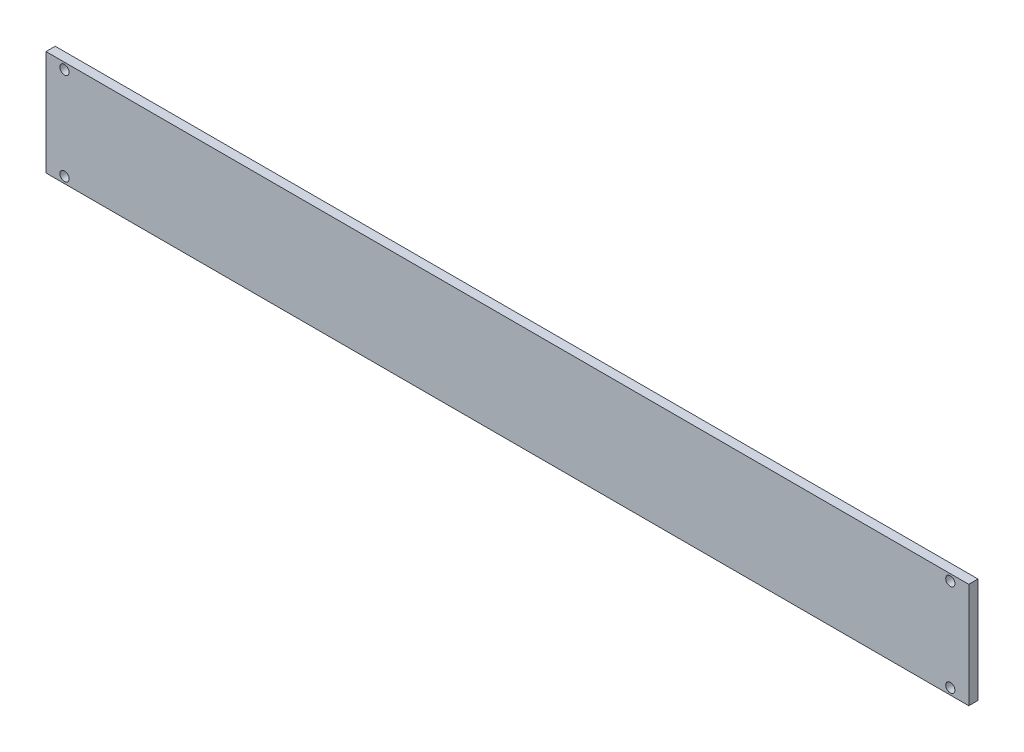
ISO-10303-21;
HEADER;
FILE_DESCRIPTION(('STEP AP214'),'2;1');
FILE_NAME('part.step','',(''),(''),'','','');
FILE_SCHEMA(('AUTOMOTIVE_DESIGN { 1 0 10303 214 1 1 1 1 }'));
ENDSEC;
DATA;
#1=APPLICATION_CONTEXT('core data for automotive mechanical design processes');
#2=APPLICATION_PROTOCOL_DEFINITION('international standard','automotive_design',2000,#1);
#3=PRODUCT_CONTEXT('',#1,'mechanical');
#4=PRODUCT('Part','Part','',(#3));
#5=PRODUCT_RELATED_PRODUCT_CATEGORY('part','',(#4));
#6=PRODUCT_DEFINITION_FORMATION('','',#4);
#7=PRODUCT_DEFINITION_CONTEXT('part definition',#1,'design');
#8=PRODUCT_DEFINITION('design','',#6,#7);
#9=PRODUCT_DEFINITION_SHAPE('','',#8);
#10=(LENGTH_UNIT() NAMED_UNIT(*) SI_UNIT(.MILLI.,.METRE.));
#11=(NAMED_UNIT(*) PLANE_ANGLE_UNIT() SI_UNIT($,.RADIAN.));
#12=(NAMED_UNIT(*) SI_UNIT($,.STERADIAN.) SOLID_ANGLE_UNIT());
#13=UNCERTAINTY_MEASURE_WITH_UNIT(LENGTH_MEASURE(1.E-05),#10,'distance_accuracy_value','');
#14=(GEOMETRIC_REPRESENTATION_CONTEXT(3) GLOBAL_UNCERTAINTY_ASSIGNED_CONTEXT((#13)) GLOBAL_UNIT_ASSIGNED_CONTEXT((#10,
#11,#12)) REPRESENTATION_CONTEXT('',''));
#15=CARTESIAN_POINT('',(0.,0.,0.));
#16=DIRECTION('',(0.,0.,1.));
#17=DIRECTION('',(1.,0.,0.));
#18=AXIS2_PLACEMENT_3D('',#15,#16,#17);
#19=CARTESIAN_POINT('',(0.,0.,10.));
#20=DIRECTION('',(0.,0.,1.));
#21=DIRECTION('',(1.,0.,0.));
#22=AXIS2_PLACEMENT_3D('',#19,#20,#21);
#23=PLANE('',#22);
#24=CARTESIAN_POINT('',(480.,-50.,10.));
#25=DIRECTION('',(0.,0.,1.));
#26=DIRECTION('',(1.,0.,0.));
#27=AXIS2_PLACEMENT_3D('',#24,#25,#26);
#28=CIRCLE('',#27,4.99999999999999);
#29=CARTESIAN_POINT('',(485.,-50.,10.));
#30=VERTEX_POINT('',#29);
#31=EDGE_CURVE('E121',#30,#30,#28,.T.);
#32=ORIENTED_EDGE('',*,*,#31,.F.);
#33=EDGE_LOOP('',(#32));
#34=FACE_BOUND('',#33,.T.);
#35=CARTESIAN_POINT('',(-480.,50.,10.));
#36=DIRECTION('',(0.,0.,1.));
#37=DIRECTION('',(1.,0.,0.));
#38=AXIS2_PLACEMENT_3D('',#35,#36,#37);
#39=CIRCLE('',#38,4.99999999999999);
#40=CARTESIAN_POINT('',(-475.,50.,10.));
#41=VERTEX_POINT('',#40);
#42=EDGE_CURVE('E100',#41,#41,#39,.T.);
#43=ORIENTED_EDGE('',*,*,#42,.F.);
#44=EDGE_LOOP('',(#43));
#45=FACE_BOUND('',#44,.T.);
#46=DIRECTION('',(0.,1.,0.));
#47=VECTOR('',#46,1.);
#48=CARTESIAN_POINT('',(500.,57.,10.));
#49=LINE('',#48,#47);
#50=CARTESIAN_POINT('',(500.,-57.,10.));
#51=VERTEX_POINT('',#50);
#52=CARTESIAN_POINT('',(500.,57.,10.));
#53=VERTEX_POINT('',#52);
#54=EDGE_CURVE('E85',#51,#53,#49,.T.);
#55=ORIENTED_EDGE('',*,*,#54,.T.);
#56=DIRECTION('',(-1.,0.,0.));
#57=VECTOR('',#56,1.);
#58=CARTESIAN_POINT('',(-500.,57.,10.));
#59=LINE('',#58,#57);
#60=CARTESIAN_POINT('',(-500.,57.,10.));
#61=VERTEX_POINT('',#60);
#62=EDGE_CURVE('E80',#53,#61,#59,.T.);
#63=ORIENTED_EDGE('',*,*,#62,.T.);
#64=DIRECTION('',(0.,-1.,0.));
#65=VECTOR('',#64,1.);
#66=CARTESIAN_POINT('',(-500.,57.,10.));
#67=LINE('',#66,#65);
#68=CARTESIAN_POINT('',(-500.,-57.,10.));
#69=VERTEX_POINT('',#68);
#70=EDGE_CURVE('E83',#61,#69,#67,.T.);
#71=ORIENTED_EDGE('',*,*,#70,.T.);
#72=DIRECTION('',(1.,0.,0.));
#73=VECTOR('',#72,1.);
#74=CARTESIAN_POINT('',(-500.,-57.,10.));
#75=LINE('',#74,#73);
#76=EDGE_CURVE('E50',#69,#51,#75,.T.);
#77=ORIENTED_EDGE('',*,*,#76,.T.);
#78=EDGE_LOOP('',(#55,#63,#71,#77));
#79=FACE_BOUND('',#78,.T.);
#80=CARTESIAN_POINT('',(-480.,-50.,10.));
#81=DIRECTION('',(0.,0.,1.));
#82=DIRECTION('',(1.,0.,0.));
#83=AXIS2_PLACEMENT_3D('',#80,#81,#82);
#84=CIRCLE('',#83,4.99999999999999);
#85=CARTESIAN_POINT('',(-475.,-50.,10.));
#86=VERTEX_POINT('',#85);
#87=EDGE_CURVE('E115',#86,#86,#84,.T.);
#88=ORIENTED_EDGE('',*,*,#87,.F.);
#89=EDGE_LOOP('',(#88));
#90=FACE_BOUND('',#89,.T.);
#91=CARTESIAN_POINT('',(480.,50.,10.));
#92=DIRECTION('',(0.,0.,1.));
#93=DIRECTION('',(1.,0.,0.));
#94=AXIS2_PLACEMENT_3D('',#91,#92,#93);
#95=CIRCLE('',#94,4.99999999999999);
#96=CARTESIAN_POINT('',(485.,50.,10.));
#97=VERTEX_POINT('',#96);
#98=EDGE_CURVE('E127',#97,#97,#95,.T.);
#99=ORIENTED_EDGE('',*,*,#98,.F.);
#100=EDGE_LOOP('',(#99));
#101=FACE_BOUND('',#100,.T.);
#102=ADVANCED_FACE('F33',(#34,#45,#79,#90,#101),#23,.T.);
#103=CARTESIAN_POINT('',(0.,0.,0.));
#104=DIRECTION('',(0.,0.,1.));
#105=DIRECTION('',(1.,0.,0.));
#106=AXIS2_PLACEMENT_3D('',#103,#104,#105);
#107=PLANE('',#106);
#108=DIRECTION('',(0.,1.,0.));
#109=VECTOR('',#108,1.);
#110=CARTESIAN_POINT('',(500.,57.,0.));
#111=LINE('',#110,#109);
#112=CARTESIAN_POINT('',(500.,-57.,0.));
#113=VERTEX_POINT('',#112);
#114=CARTESIAN_POINT('',(500.,57.,0.));
#115=VERTEX_POINT('',#114);
#116=EDGE_CURVE('E97',#113,#115,#111,.T.);
#117=ORIENTED_EDGE('',*,*,#116,.F.);
#118=DIRECTION('',(1.,0.,0.));
#119=VECTOR('',#118,1.);
#120=CARTESIAN_POINT('',(-500.,-57.,0.));
#121=LINE('',#120,#119);
#122=CARTESIAN_POINT('',(-500.,-57.,0.));
#123=VERTEX_POINT('',#122);
#124=EDGE_CURVE('E73',#123,#113,#121,.T.);
#125=ORIENTED_EDGE('',*,*,#124,.F.);
#126=DIRECTION('',(0.,-1.,0.));
#127=VECTOR('',#126,1.);
#128=CARTESIAN_POINT('',(-500.,57.,0.));
#129=LINE('',#128,#127);
#130=CARTESIAN_POINT('',(-500.,57.,0.));
#131=VERTEX_POINT('',#130);
#132=EDGE_CURVE('E67',#131,#123,#129,.T.);
#133=ORIENTED_EDGE('',*,*,#132,.F.);
#134=DIRECTION('',(-1.,0.,0.));
#135=VECTOR('',#134,1.);
#136=CARTESIAN_POINT('',(-500.,57.,0.));
#137=LINE('',#136,#135);
#138=EDGE_CURVE('E89',#115,#131,#137,.T.);
#139=ORIENTED_EDGE('',*,*,#138,.F.);
#140=EDGE_LOOP('',(#117,#125,#133,#139));
#141=FACE_BOUND('',#140,.T.);
#142=CARTESIAN_POINT('',(-480.,50.,0.));
#143=DIRECTION('',(0.,0.,1.));
#144=DIRECTION('',(1.,0.,0.));
#145=AXIS2_PLACEMENT_3D('',#142,#143,#144);
#146=CIRCLE('',#145,4.99999999999999);
#147=CARTESIAN_POINT('',(-475.,50.,0.));
#148=VERTEX_POINT('',#147);
#149=EDGE_CURVE('E112',#148,#148,#146,.T.);
#150=ORIENTED_EDGE('',*,*,#149,.T.);
#151=EDGE_LOOP('',(#150));
#152=FACE_BOUND('',#151,.T.);
#153=CARTESIAN_POINT('',(-480.,-50.,0.));
#154=DIRECTION('',(0.,0.,1.));
#155=DIRECTION('',(1.,0.,0.));
#156=AXIS2_PLACEMENT_3D('',#153,#154,#155);
#157=CIRCLE('',#156,4.99999999999999);
#158=CARTESIAN_POINT('',(-475.,-50.,0.));
#159=VERTEX_POINT('',#158);
#160=EDGE_CURVE('E118',#159,#159,#157,.T.);
#161=ORIENTED_EDGE('',*,*,#160,.T.);
#162=EDGE_LOOP('',(#161));
#163=FACE_BOUND('',#162,.T.);
#164=CARTESIAN_POINT('',(480.,-50.,0.));
#165=DIRECTION('',(0.,0.,1.));
#166=DIRECTION('',(1.,0.,0.));
#167=AXIS2_PLACEMENT_3D('',#164,#165,#166);
#168=CIRCLE('',#167,4.99999999999999);
#169=CARTESIAN_POINT('',(485.,-50.,0.));
#170=VERTEX_POINT('',#169);
#171=EDGE_CURVE('E124',#170,#170,#168,.T.);
#172=ORIENTED_EDGE('',*,*,#171,.T.);
#173=EDGE_LOOP('',(#172));
#174=FACE_BOUND('',#173,.T.);
#175=CARTESIAN_POINT('',(480.,50.,0.));
#176=DIRECTION('',(0.,0.,1.));
#177=DIRECTION('',(1.,0.,0.));
#178=AXIS2_PLACEMENT_3D('',#175,#176,#177);
#179=CIRCLE('',#178,4.99999999999999);
#180=CARTESIAN_POINT('',(485.,50.,0.));
#181=VERTEX_POINT('',#180);
#182=EDGE_CURVE('E130',#181,#181,#179,.T.);
#183=ORIENTED_EDGE('',*,*,#182,.T.);
#184=EDGE_LOOP('',(#183));
#185=FACE_BOUND('',#184,.T.);
#186=ADVANCED_FACE('F108',(#141,#152,#163,#174,#185),#107,.F.);
#187=CARTESIAN_POINT('',(500.,57.,10.));
#188=DIRECTION('',(-1.,0.,0.));
#189=DIRECTION('',(0.,-1.,0.));
#190=AXIS2_PLACEMENT_3D('',#187,#188,#189);
#191=PLANE('',#190);
#192=ORIENTED_EDGE('',*,*,#116,.T.);
#193=DIRECTION('',(0.,0.,-1.));
#194=VECTOR('',#193,1.);
#195=CARTESIAN_POINT('',(500.,57.,10.));
#196=LINE('',#195,#194);
#197=EDGE_CURVE('E11',#53,#115,#196,.T.);
#198=ORIENTED_EDGE('',*,*,#197,.F.);
#199=ORIENTED_EDGE('',*,*,#54,.F.);
#200=DIRECTION('',(0.,0.,-1.));
#201=VECTOR('',#200,1.);
#202=CARTESIAN_POINT('',(500.,-57.,10.));
#203=LINE('',#202,#201);
#204=EDGE_CURVE('E93',#51,#113,#203,.T.);
#205=ORIENTED_EDGE('',*,*,#204,.T.);
#206=EDGE_LOOP('',(#192,#198,#199,#205));
#207=FACE_BOUND('',#206,.T.);
#208=ADVANCED_FACE('F35',(#207),#191,.F.);
#209=CARTESIAN_POINT('',(-500.,57.,10.));
#210=DIRECTION('',(0.,-1.,0.));
#211=DIRECTION('',(0.,0.,-1.));
#212=AXIS2_PLACEMENT_3D('',#209,#210,#211);
#213=PLANE('',#212);
#214=ORIENTED_EDGE('',*,*,#138,.T.);
#215=DIRECTION('',(0.,0.,-1.));
#216=VECTOR('',#215,1.);
#217=CARTESIAN_POINT('',(-500.,57.,10.));
#218=LINE('',#217,#216);
#219=EDGE_CURVE('E42',#61,#131,#218,.T.);
#220=ORIENTED_EDGE('',*,*,#219,.F.);
#221=ORIENTED_EDGE('',*,*,#62,.F.);
#222=ORIENTED_EDGE('',*,*,#197,.T.);
#223=EDGE_LOOP('',(#214,#220,#221,#222));
#224=FACE_BOUND('',#223,.T.);
#225=ADVANCED_FACE('F88',(#224),#213,.F.);
#226=CARTESIAN_POINT('',(-500.,57.,10.));
#227=DIRECTION('',(1.,0.,0.));
#228=DIRECTION('',(0.,0.,-1.));
#229=AXIS2_PLACEMENT_3D('',#226,#227,#228);
#230=PLANE('',#229);
#231=ORIENTED_EDGE('',*,*,#132,.T.);
#232=DIRECTION('',(0.,0.,-1.));
#233=VECTOR('',#232,1.);
#234=CARTESIAN_POINT('',(-500.,-57.,10.));
#235=LINE('',#234,#233);
#236=EDGE_CURVE('E90',#69,#123,#235,.T.);
#237=ORIENTED_EDGE('',*,*,#236,.F.);
#238=ORIENTED_EDGE('',*,*,#70,.F.);
#239=ORIENTED_EDGE('',*,*,#219,.T.);
#240=EDGE_LOOP('',(#231,#237,#238,#239));
#241=FACE_BOUND('',#240,.T.);
#242=ADVANCED_FACE('F91',(#241),#230,.F.);
#243=CARTESIAN_POINT('',(-500.,-57.,10.));
#244=DIRECTION('',(0.,1.,0.));
#245=DIRECTION('',(0.,0.,1.));
#246=AXIS2_PLACEMENT_3D('',#243,#244,#245);
#247=PLANE('',#246);
#248=ORIENTED_EDGE('',*,*,#124,.T.);
#249=ORIENTED_EDGE('',*,*,#204,.F.);
#250=ORIENTED_EDGE('',*,*,#76,.F.);
#251=ORIENTED_EDGE('',*,*,#236,.T.);
#252=EDGE_LOOP('',(#248,#249,#250,#251));
#253=FACE_BOUND('',#252,.T.);
#254=ADVANCED_FACE('F105',(#253),#247,.F.);
#255=CARTESIAN_POINT('',(-480.,50.,10.));
#256=DIRECTION('',(0.,0.,-1.));
#257=DIRECTION('',(-1.,0.,0.));
#258=AXIS2_PLACEMENT_3D('',#255,#256,#257);
#259=CYLINDRICAL_SURFACE('',#258,4.99999999999999);
#260=ORIENTED_EDGE('',*,*,#42,.T.);
#261=EDGE_LOOP('',(#260));
#262=FACE_BOUND('',#261,.T.);
#263=ORIENTED_EDGE('',*,*,#149,.F.);
#264=EDGE_LOOP('',(#263));
#265=FACE_BOUND('',#264,.T.);
#266=ADVANCED_FACE('F149',(#262,#265),#259,.F.);
#267=CARTESIAN_POINT('',(-480.,-50.,10.));
#268=DIRECTION('',(0.,0.,-1.));
#269=DIRECTION('',(-1.,0.,0.));
#270=AXIS2_PLACEMENT_3D('',#267,#268,#269);
#271=CYLINDRICAL_SURFACE('',#270,4.99999999999999);
#272=ORIENTED_EDGE('',*,*,#87,.T.);
#273=EDGE_LOOP('',(#272));
#274=FACE_BOUND('',#273,.T.);
#275=ORIENTED_EDGE('',*,*,#160,.F.);
#276=EDGE_LOOP('',(#275));
#277=FACE_BOUND('',#276,.T.);
#278=ADVANCED_FACE('F195',(#274,#277),#271,.F.);
#279=CARTESIAN_POINT('',(480.,-50.,10.));
#280=DIRECTION('',(0.,0.,-1.));
#281=DIRECTION('',(-1.,0.,0.));
#282=AXIS2_PLACEMENT_3D('',#279,#280,#281);
#283=CYLINDRICAL_SURFACE('',#282,4.99999999999999);
#284=ORIENTED_EDGE('',*,*,#31,.T.);
#285=EDGE_LOOP('',(#284));
#286=FACE_BOUND('',#285,.T.);
#287=ORIENTED_EDGE('',*,*,#171,.F.);
#288=EDGE_LOOP('',(#287));
#289=FACE_BOUND('',#288,.T.);
#290=ADVANCED_FACE('F203',(#286,#289),#283,.F.);
#291=CARTESIAN_POINT('',(480.,50.,10.));
#292=DIRECTION('',(0.,0.,-1.));
#293=DIRECTION('',(-1.,0.,0.));
#294=AXIS2_PLACEMENT_3D('',#291,#292,#293);
#295=CYLINDRICAL_SURFACE('',#294,4.99999999999999);
#296=ORIENTED_EDGE('',*,*,#98,.T.);
#297=EDGE_LOOP('',(#296));
#298=FACE_BOUND('',#297,.T.);
#299=ORIENTED_EDGE('',*,*,#182,.F.);
#300=EDGE_LOOP('',(#299));
#301=FACE_BOUND('',#300,.T.);
#302=ADVANCED_FACE('F136',(#298,#301),#295,.F.);
#303=CLOSED_SHELL('',(#102,#186,#208,#225,#242,#254,#266,#278,#290,#302));
#304=MANIFOLD_SOLID_BREP('B2',#303);
#305=ADVANCED_BREP_SHAPE_REPRESENTATION('',(#18,#304),#14);
#306=SHAPE_DEFINITION_REPRESENTATION(#9,#305);
ENDSEC;
END-ISO-10303-21;
